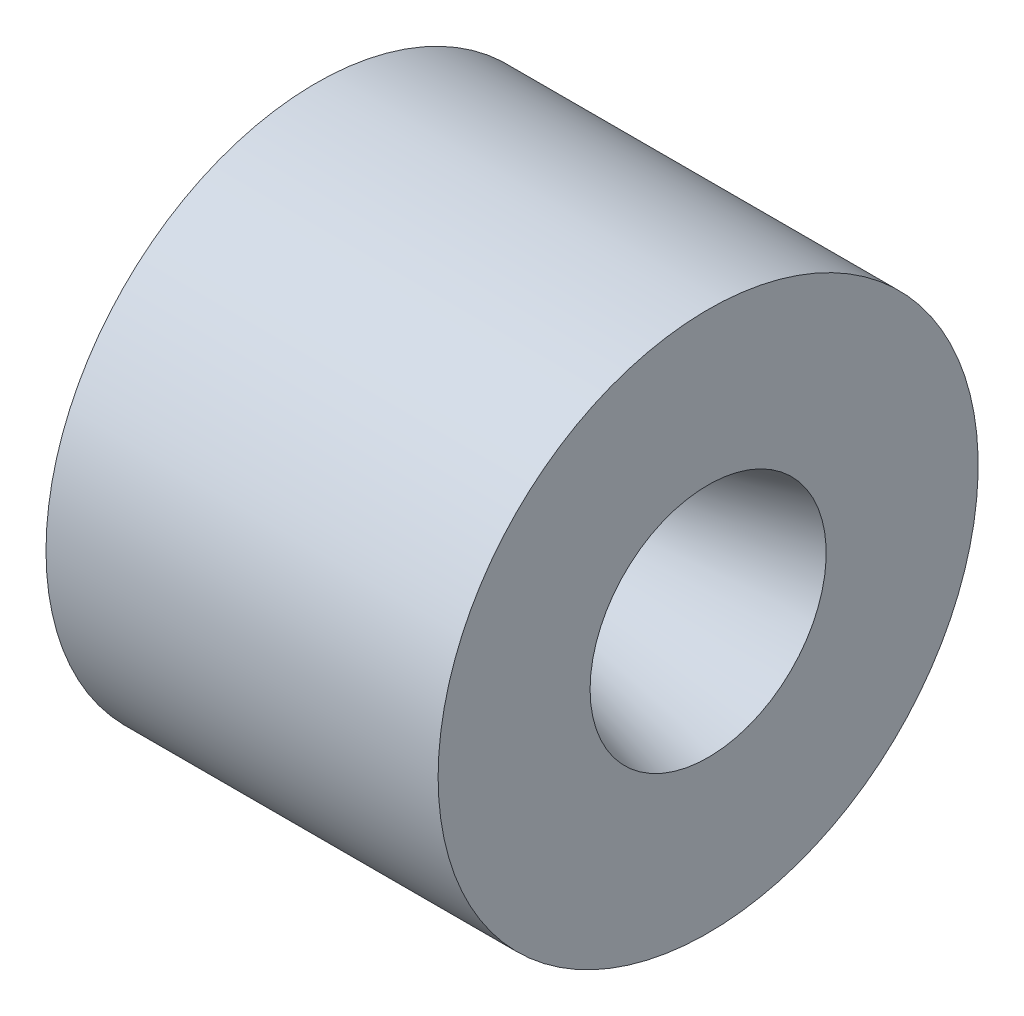
ISO-10303-21;
HEADER;
FILE_DESCRIPTION(('STEP AP214'),'2;1');
FILE_NAME('part.step','',(''),(''),'','','');
FILE_SCHEMA(('AUTOMOTIVE_DESIGN { 1 0 10303 214 1 1 1 1 }'));
ENDSEC;
DATA;
#1=APPLICATION_CONTEXT('core data for automotive mechanical design processes');
#2=APPLICATION_PROTOCOL_DEFINITION('international standard','automotive_design',2000,#1);
#3=PRODUCT_CONTEXT('',#1,'mechanical');
#4=PRODUCT('Part','Part','',(#3));
#5=PRODUCT_RELATED_PRODUCT_CATEGORY('part','',(#4));
#6=PRODUCT_DEFINITION_FORMATION('','',#4);
#7=PRODUCT_DEFINITION_CONTEXT('part definition',#1,'design');
#8=PRODUCT_DEFINITION('design','',#6,#7);
#9=PRODUCT_DEFINITION_SHAPE('','',#8);
#10=(LENGTH_UNIT() NAMED_UNIT(*) SI_UNIT(.MILLI.,.METRE.));
#11=(NAMED_UNIT(*) PLANE_ANGLE_UNIT() SI_UNIT($,.RADIAN.));
#12=(NAMED_UNIT(*) SI_UNIT($,.STERADIAN.) SOLID_ANGLE_UNIT());
#13=UNCERTAINTY_MEASURE_WITH_UNIT(LENGTH_MEASURE(1.E-05),#10,'distance_accuracy_value','');
#14=(GEOMETRIC_REPRESENTATION_CONTEXT(3) GLOBAL_UNCERTAINTY_ASSIGNED_CONTEXT((#13)) GLOBAL_UNIT_ASSIGNED_CONTEXT((#10,
#11,#12)) REPRESENTATION_CONTEXT('',''));
#15=CARTESIAN_POINT('',(0.,0.,0.));
#16=DIRECTION('',(0.,0.,1.));
#17=DIRECTION('',(1.,0.,0.));
#18=AXIS2_PLACEMENT_3D('',#15,#16,#17);
#19=CARTESIAN_POINT('',(3.175,24.13,0.));
#20=DIRECTION('',(1.,0.,0.));
#21=DIRECTION('',(0.,0.,-1.));
#22=AXIS2_PLACEMENT_3D('',#19,#20,#21);
#23=PLANE('',#22);
#24=CARTESIAN_POINT('',(3.175,0.,0.));
#25=DIRECTION('',(-1.,0.,0.));
#26=DIRECTION('',(0.,0.,1.));
#27=AXIS2_PLACEMENT_3D('',#24,#25,#26);
#28=CIRCLE('',#27,15.875);
#29=CARTESIAN_POINT('',(3.175,0.,15.875));
#30=VERTEX_POINT('',#29);
#31=EDGE_CURVE('E55',#30,#30,#28,.T.);
#32=ORIENTED_EDGE('',*,*,#31,.F.);
#33=EDGE_LOOP('',(#32));
#34=FACE_BOUND('',#33,.T.);
#35=CARTESIAN_POINT('',(3.175,0.,0.));
#36=DIRECTION('',(-1.,0.,0.));
#37=DIRECTION('',(0.,0.,1.));
#38=AXIS2_PLACEMENT_3D('',#35,#36,#37);
#39=CIRCLE('',#38,19.6723);
#40=CARTESIAN_POINT('',(3.175,0.,19.6723));
#41=VERTEX_POINT('',#40);
#42=EDGE_CURVE('E91',#41,#41,#39,.T.);
#43=ORIENTED_EDGE('',*,*,#42,.T.);
#44=EDGE_LOOP('',(#43));
#45=FACE_BOUND('',#44,.T.);
#46=ADVANCED_FACE('F42',(#34,#45),#23,.F.);
#47=CARTESIAN_POINT('',(0.,27.305,0.));
#48=DIRECTION('',(1.,0.,0.));
#49=DIRECTION('',(0.,0.,-1.));
#50=AXIS2_PLACEMENT_3D('',#47,#48,#49);
#51=PLANE('',#50);
#52=CARTESIAN_POINT('',(0.,0.,0.));
#53=DIRECTION('',(-1.,0.,0.));
#54=DIRECTION('',(0.,0.,1.));
#55=AXIS2_PLACEMENT_3D('',#52,#53,#54);
#56=CIRCLE('',#55,24.13);
#57=CARTESIAN_POINT('',(0.,0.,24.13));
#58=VERTEX_POINT('',#57);
#59=EDGE_CURVE('E10',#58,#58,#56,.T.);
#60=ORIENTED_EDGE('',*,*,#59,.F.);
#61=EDGE_LOOP('',(#60));
#62=FACE_BOUND('',#61,.T.);
#63=CARTESIAN_POINT('',(0.,0.,0.));
#64=DIRECTION('',(-1.,0.,0.));
#65=DIRECTION('',(0.,0.,1.));
#66=AXIS2_PLACEMENT_3D('',#63,#64,#65);
#67=CIRCLE('',#66,27.305);
#68=CARTESIAN_POINT('',(0.,0.,27.305));
#69=VERTEX_POINT('',#68);
#70=EDGE_CURVE('E78',#69,#69,#67,.T.);
#71=ORIENTED_EDGE('',*,*,#70,.T.);
#72=EDGE_LOOP('',(#71));
#73=FACE_BOUND('',#72,.T.);
#74=ADVANCED_FACE('F44',(#62,#73),#51,.F.);
#75=CARTESIAN_POINT('',(0.,0.,0.));
#76=DIRECTION('',(-1.,0.,0.));
#77=DIRECTION('',(0.,0.,1.));
#78=AXIS2_PLACEMENT_3D('',#75,#76,#77);
#79=CYLINDRICAL_SURFACE('',#78,24.13);
#80=CARTESIAN_POINT('',(3.175,0.,0.));
#81=DIRECTION('',(-1.,0.,0.));
#82=DIRECTION('',(0.,0.,1.));
#83=AXIS2_PLACEMENT_3D('',#80,#81,#82);
#84=CIRCLE('',#83,24.13);
#85=CARTESIAN_POINT('',(3.175,0.,24.13));
#86=VERTEX_POINT('',#85);
#87=EDGE_CURVE('E50',#86,#86,#84,.T.);
#88=ORIENTED_EDGE('',*,*,#87,.F.);
#89=EDGE_LOOP('',(#88));
#90=FACE_BOUND('',#89,.T.);
#91=ORIENTED_EDGE('',*,*,#59,.T.);
#92=EDGE_LOOP('',(#91));
#93=FACE_BOUND('',#92,.T.);
#94=ADVANCED_FACE('F118',(#90,#93),#79,.F.);
#95=CARTESIAN_POINT('',(3.175,0.,0.));
#96=DIRECTION('',(-1.,0.,0.));
#97=DIRECTION('',(0.,0.,1.));
#98=AXIS2_PLACEMENT_3D('',#95,#96,#97);
#99=CIRCLE('',#98,22.2885);
#100=CARTESIAN_POINT('',(3.175,0.,22.2885));
#101=VERTEX_POINT('',#100);
#102=EDGE_CURVE('E83',#101,#101,#99,.T.);
#103=ORIENTED_EDGE('',*,*,#102,.F.);
#104=EDGE_LOOP('',(#103));
#105=FACE_BOUND('',#104,.T.);
#106=ORIENTED_EDGE('',*,*,#87,.T.);
#107=EDGE_LOOP('',(#106));
#108=FACE_BOUND('',#107,.T.);
#109=ADVANCED_FACE('F115',(#105,#108),#23,.F.);
#110=CARTESIAN_POINT('',(3.175,0.,0.));
#111=DIRECTION('',(-1.,0.,0.));
#112=DIRECTION('',(0.,0.,1.));
#113=AXIS2_PLACEMENT_3D('',#110,#111,#112);
#114=CONICAL_SURFACE('',#113,15.875,0.785398163397445);
#115=CARTESIAN_POINT('',(12.7000000000001,0.,0.));
#116=DIRECTION('',(-1.,0.,0.));
#117=DIRECTION('',(0.,0.,1.));
#118=AXIS2_PLACEMENT_3D('',#115,#116,#117);
#119=CIRCLE('',#118,6.35);
#120=CARTESIAN_POINT('',(12.7000000000001,0.,6.35));
#121=VERTEX_POINT('',#120);
#122=EDGE_CURVE('E60',#121,#121,#119,.T.);
#123=ORIENTED_EDGE('',*,*,#122,.F.);
#124=EDGE_LOOP('',(#123));
#125=FACE_BOUND('',#124,.T.);
#126=ORIENTED_EDGE('',*,*,#31,.T.);
#127=EDGE_LOOP('',(#126));
#128=FACE_BOUND('',#127,.T.);
#129=ADVANCED_FACE('F117',(#125,#128),#114,.F.);
#130=CARTESIAN_POINT('',(0.,0.,0.));
#131=DIRECTION('',(-1.,0.,0.));
#132=DIRECTION('',(0.,0.,1.));
#133=AXIS2_PLACEMENT_3D('',#130,#131,#132);
#134=CYLINDRICAL_SURFACE('',#133,6.35);
#135=CARTESIAN_POINT('',(18.7960000000001,0.,0.));
#136=DIRECTION('',(-1.,0.,0.));
#137=DIRECTION('',(0.,0.,1.));
#138=AXIS2_PLACEMENT_3D('',#135,#136,#137);
#139=CIRCLE('',#138,6.35);
#140=CARTESIAN_POINT('',(18.7960000000001,0.,6.35));
#141=VERTEX_POINT('',#140);
#142=EDGE_CURVE('E66',#141,#141,#139,.T.);
#143=ORIENTED_EDGE('',*,*,#142,.F.);
#144=EDGE_LOOP('',(#143));
#145=FACE_BOUND('',#144,.T.);
#146=ORIENTED_EDGE('',*,*,#122,.T.);
#147=EDGE_LOOP('',(#146));
#148=FACE_BOUND('',#147,.T.);
#149=ADVANCED_FACE('F124',(#145,#148),#134,.F.);
#150=CARTESIAN_POINT('',(18.7960000000001,0.,0.));
#151=DIRECTION('',(1.,0.,0.));
#152=DIRECTION('',(0.,0.,-1.));
#153=AXIS2_PLACEMENT_3D('',#150,#151,#152);
#154=CONICAL_SURFACE('',#153,6.35,0.26179938779915);
#155=CARTESIAN_POINT('',(39.6506999126949,0.,0.));
#156=DIRECTION('',(-1.,0.,0.));
#157=DIRECTION('',(0.,0.,1.));
#158=AXIS2_PLACEMENT_3D('',#155,#156,#157);
#159=CIRCLE('',#158,11.938);
#160=CARTESIAN_POINT('',(39.6506999126949,0.,11.938));
#161=VERTEX_POINT('',#160);
#162=EDGE_CURVE('E70',#161,#161,#159,.T.);
#163=ORIENTED_EDGE('',*,*,#162,.F.);
#164=EDGE_LOOP('',(#163));
#165=FACE_BOUND('',#164,.T.);
#166=ORIENTED_EDGE('',*,*,#142,.T.);
#167=EDGE_LOOP('',(#166));
#168=FACE_BOUND('',#167,.T.);
#169=ADVANCED_FACE('F148',(#165,#168),#154,.F.);
#170=CARTESIAN_POINT('',(39.6506999126949,11.938,0.));
#171=DIRECTION('',(-1.,0.,0.));
#172=DIRECTION('',(0.,0.,1.));
#173=AXIS2_PLACEMENT_3D('',#170,#171,#172);
#174=PLANE('',#173);
#175=CARTESIAN_POINT('',(39.6506999126949,0.,0.));
#176=DIRECTION('',(-1.,0.,0.));
#177=DIRECTION('',(0.,0.,1.));
#178=AXIS2_PLACEMENT_3D('',#175,#176,#177);
#179=CIRCLE('',#178,27.305);
#180=CARTESIAN_POINT('',(39.6506999126949,0.,27.305));
#181=VERTEX_POINT('',#180);
#182=EDGE_CURVE('E74',#181,#181,#179,.T.);
#183=ORIENTED_EDGE('',*,*,#182,.F.);
#184=EDGE_LOOP('',(#183));
#185=FACE_BOUND('',#184,.T.);
#186=ORIENTED_EDGE('',*,*,#162,.T.);
#187=EDGE_LOOP('',(#186));
#188=FACE_BOUND('',#187,.T.);
#189=ADVANCED_FACE('F144',(#185,#188),#174,.F.);
#190=CARTESIAN_POINT('',(0.,0.,0.));
#191=DIRECTION('',(-1.,0.,0.));
#192=DIRECTION('',(0.,0.,1.));
#193=AXIS2_PLACEMENT_3D('',#190,#191,#192);
#194=CYLINDRICAL_SURFACE('',#193,27.305);
#195=ORIENTED_EDGE('',*,*,#70,.F.);
#196=EDGE_LOOP('',(#195));
#197=FACE_BOUND('',#196,.T.);
#198=ORIENTED_EDGE('',*,*,#182,.T.);
#199=EDGE_LOOP('',(#198));
#200=FACE_BOUND('',#199,.T.);
#201=ADVANCED_FACE('F111',(#197,#200),#194,.T.);
#202=CARTESIAN_POINT('',(5.461,0.,0.));
#203=DIRECTION('',(-1.,0.,0.));
#204=DIRECTION('',(0.,0.,1.));
#205=AXIS2_PLACEMENT_3D('',#202,#203,#204);
#206=CYLINDRICAL_SURFACE('',#205,22.2885);
#207=CARTESIAN_POINT('',(5.461,0.,0.));
#208=DIRECTION('',(-1.,0.,0.));
#209=DIRECTION('',(0.,0.,1.));
#210=AXIS2_PLACEMENT_3D('',#207,#208,#209);
#211=CIRCLE('',#210,22.2885);
#212=CARTESIAN_POINT('',(5.461,0.,22.2885));
#213=VERTEX_POINT('',#212);
#214=EDGE_CURVE('E82',#213,#213,#211,.T.);
#215=ORIENTED_EDGE('',*,*,#214,.F.);
#216=EDGE_LOOP('',(#215));
#217=FACE_BOUND('',#216,.T.);
#218=ORIENTED_EDGE('',*,*,#102,.T.);
#219=EDGE_LOOP('',(#218));
#220=FACE_BOUND('',#219,.T.);
#221=ADVANCED_FACE('F105',(#217,#220),#206,.F.);
#222=CARTESIAN_POINT('',(5.461,0.,0.));
#223=DIRECTION('',(-1.,0.,0.));
#224=DIRECTION('',(0.,0.,1.));
#225=AXIS2_PLACEMENT_3D('',#222,#223,#224);
#226=PLANE('',#225);
#227=CARTESIAN_POINT('',(5.461,0.,0.));
#228=DIRECTION('',(-1.,0.,0.));
#229=DIRECTION('',(0.,0.,1.));
#230=AXIS2_PLACEMENT_3D('',#227,#228,#229);
#231=CIRCLE('',#230,19.6723);
#232=CARTESIAN_POINT('',(5.461,0.,19.6723));
#233=VERTEX_POINT('',#232);
#234=EDGE_CURVE('E87',#233,#233,#231,.T.);
#235=ORIENTED_EDGE('',*,*,#234,.F.);
#236=EDGE_LOOP('',(#235));
#237=FACE_BOUND('',#236,.T.);
#238=ORIENTED_EDGE('',*,*,#214,.T.);
#239=EDGE_LOOP('',(#238));
#240=FACE_BOUND('',#239,.T.);
#241=ADVANCED_FACE('F102',(#237,#240),#226,.T.);
#242=CARTESIAN_POINT('',(5.461,0.,0.));
#243=DIRECTION('',(-1.,0.,0.));
#244=DIRECTION('',(0.,0.,1.));
#245=AXIS2_PLACEMENT_3D('',#242,#243,#244);
#246=CYLINDRICAL_SURFACE('',#245,19.6723);
#247=ORIENTED_EDGE('',*,*,#234,.T.);
#248=EDGE_LOOP('',(#247));
#249=FACE_BOUND('',#248,.T.);
#250=ORIENTED_EDGE('',*,*,#42,.F.);
#251=EDGE_LOOP('',(#250));
#252=FACE_BOUND('',#251,.T.);
#253=ADVANCED_FACE('F99',(#249,#252),#246,.T.);
#254=CLOSED_SHELL('',(#46,#74,#94,#109,#129,#149,#169,#189,#201,#221,#241,#253));
#255=MANIFOLD_SOLID_BREP('B2',#254);
#256=ADVANCED_BREP_SHAPE_REPRESENTATION('',(#18,#255),#14);
#257=SHAPE_DEFINITION_REPRESENTATION(#9,#256);
ENDSEC;
END-ISO-10303-21;
